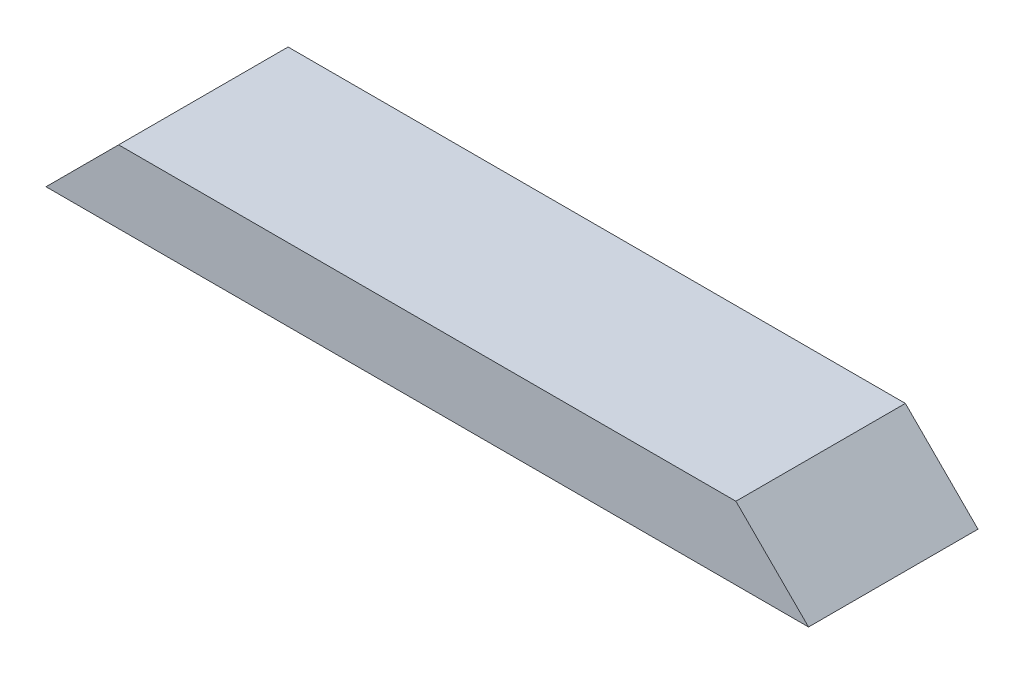
ISO-10303-21;
HEADER;
FILE_DESCRIPTION(('STEP AP214'),'2;1');
FILE_NAME('part.step','',(''),(''),'','','');
FILE_SCHEMA(('AUTOMOTIVE_DESIGN { 1 0 10303 214 1 1 1 1 }'));
ENDSEC;
DATA;
#1=APPLICATION_CONTEXT('core data for automotive mechanical design processes');
#2=APPLICATION_PROTOCOL_DEFINITION('international standard','automotive_design',2000,#1);
#3=PRODUCT_CONTEXT('',#1,'mechanical');
#4=PRODUCT('Part','Part','',(#3));
#5=PRODUCT_RELATED_PRODUCT_CATEGORY('part','',(#4));
#6=PRODUCT_DEFINITION_FORMATION('','',#4);
#7=PRODUCT_DEFINITION_CONTEXT('part definition',#1,'design');
#8=PRODUCT_DEFINITION('design','',#6,#7);
#9=PRODUCT_DEFINITION_SHAPE('','',#8);
#10=(LENGTH_UNIT() NAMED_UNIT(*) SI_UNIT(.MILLI.,.METRE.));
#11=(NAMED_UNIT(*) PLANE_ANGLE_UNIT() SI_UNIT($,.RADIAN.));
#12=(NAMED_UNIT(*) SI_UNIT($,.STERADIAN.) SOLID_ANGLE_UNIT());
#13=UNCERTAINTY_MEASURE_WITH_UNIT(LENGTH_MEASURE(1.E-05),#10,'distance_accuracy_value','');
#14=(GEOMETRIC_REPRESENTATION_CONTEXT(3) GLOBAL_UNCERTAINTY_ASSIGNED_CONTEXT((#13)) GLOBAL_UNIT_ASSIGNED_CONTEXT((#10,
#11,#12)) REPRESENTATION_CONTEXT('',''));
#15=CARTESIAN_POINT('',(0.,0.,0.));
#16=DIRECTION('',(0.,0.,1.));
#17=DIRECTION('',(1.,0.,0.));
#18=AXIS2_PLACEMENT_3D('',#15,#16,#17);
#19=CARTESIAN_POINT('',(0.,38.1,0.));
#20=DIRECTION('',(0.,0.,-1.));
#21=DIRECTION('',(-1.,0.,0.));
#22=AXIS2_PLACEMENT_3D('',#19,#20,#21);
#23=PLANE('',#22);
#24=DIRECTION('',(1.,0.,0.));
#25=VECTOR('',#24,1.);
#26=CARTESIAN_POINT('',(0.,38.1,0.));
#27=LINE('',#26,#25);
#28=CARTESIAN_POINT('',(38.1,38.1,0.));
#29=VERTEX_POINT('',#28);
#30=CARTESIAN_POINT('',(361.95,38.0999999999997,0.));
#31=VERTEX_POINT('',#30);
#32=EDGE_CURVE('E47',#29,#31,#27,.T.);
#33=ORIENTED_EDGE('',*,*,#32,.F.);
#34=DIRECTION('',(0.707106781186547,0.707106781186547,0.));
#35=VECTOR('',#34,1.);
#36=CARTESIAN_POINT('',(0.,0.,0.));
#37=LINE('',#36,#35);
#38=CARTESIAN_POINT('',(0.,0.,0.));
#39=VERTEX_POINT('',#38);
#40=EDGE_CURVE('E82',#39,#29,#37,.T.);
#41=ORIENTED_EDGE('',*,*,#40,.F.);
#42=DIRECTION('',(1.,0.,0.));
#43=VECTOR('',#42,1.);
#44=CARTESIAN_POINT('',(0.,0.,0.));
#45=LINE('',#44,#43);
#46=CARTESIAN_POINT('',(400.05,0.,0.));
#47=VERTEX_POINT('',#46);
#48=EDGE_CURVE('E87',#39,#47,#45,.T.);
#49=ORIENTED_EDGE('',*,*,#48,.T.);
#50=DIRECTION('',(0.70710678118655,-0.707106781186545,0.));
#51=VECTOR('',#50,1.);
#52=CARTESIAN_POINT('',(361.95,38.0999999999997,0.));
#53=LINE('',#52,#51);
#54=EDGE_CURVE('E63',#31,#47,#53,.T.);
#55=ORIENTED_EDGE('',*,*,#54,.F.);
#56=EDGE_LOOP('',(#33,#41,#49,#55));
#57=FACE_BOUND('',#56,.T.);
#58=ADVANCED_FACE('F39',(#57),#23,.F.);
#59=CARTESIAN_POINT('',(0.,38.1,-88.9));
#60=DIRECTION('',(0.,0.,1.));
#61=DIRECTION('',(1.,0.,0.));
#62=AXIS2_PLACEMENT_3D('',#59,#60,#61);
#63=PLANE('',#62);
#64=DIRECTION('',(-1.,0.,0.));
#65=VECTOR('',#64,1.);
#66=CARTESIAN_POINT('',(0.,0.,-88.9));
#67=LINE('',#66,#65);
#68=CARTESIAN_POINT('',(400.05,0.,-88.9));
#69=VERTEX_POINT('',#68);
#70=CARTESIAN_POINT('',(0.,0.,-88.9));
#71=VERTEX_POINT('',#70);
#72=EDGE_CURVE('E42',#69,#71,#67,.T.);
#73=ORIENTED_EDGE('',*,*,#72,.T.);
#74=DIRECTION('',(0.707106781186547,0.707106781186547,0.));
#75=VECTOR('',#74,1.);
#76=CARTESIAN_POINT('',(0.,0.,-88.9));
#77=LINE('',#76,#75);
#78=CARTESIAN_POINT('',(38.1,38.1,-88.9));
#79=VERTEX_POINT('',#78);
#80=EDGE_CURVE('E55',#71,#79,#77,.T.);
#81=ORIENTED_EDGE('',*,*,#80,.T.);
#82=DIRECTION('',(-1.,0.,0.));
#83=VECTOR('',#82,1.);
#84=CARTESIAN_POINT('',(0.,38.1,-88.9));
#85=LINE('',#84,#83);
#86=CARTESIAN_POINT('',(361.95,38.0999999999997,-88.9));
#87=VERTEX_POINT('',#86);
#88=EDGE_CURVE('E11',#87,#79,#85,.T.);
#89=ORIENTED_EDGE('',*,*,#88,.F.);
#90=DIRECTION('',(0.70710678118655,-0.707106781186545,0.));
#91=VECTOR('',#90,1.);
#92=CARTESIAN_POINT('',(361.95,38.0999999999997,-88.9));
#93=LINE('',#92,#91);
#94=EDGE_CURVE('E100',#87,#69,#93,.T.);
#95=ORIENTED_EDGE('',*,*,#94,.T.);
#96=EDGE_LOOP('',(#73,#81,#89,#95));
#97=FACE_BOUND('',#96,.T.);
#98=ADVANCED_FACE('F109',(#97),#63,.F.);
#99=CARTESIAN_POINT('',(0.,38.1,0.));
#100=DIRECTION('',(0.,-1.,0.));
#101=DIRECTION('',(0.,0.,-1.));
#102=AXIS2_PLACEMENT_3D('',#99,#100,#101);
#103=PLANE('',#102);
#104=ORIENTED_EDGE('',*,*,#88,.T.);
#105=DIRECTION('',(0.,0.,1.));
#106=VECTOR('',#105,1.);
#107=CARTESIAN_POINT('',(38.1,38.1,-88.9));
#108=LINE('',#107,#106);
#109=EDGE_CURVE('E88',#79,#29,#108,.T.);
#110=ORIENTED_EDGE('',*,*,#109,.T.);
#111=ORIENTED_EDGE('',*,*,#32,.T.);
#112=DIRECTION('',(0.,0.,1.));
#113=VECTOR('',#112,1.);
#114=CARTESIAN_POINT('',(361.95,38.0999999999997,-88.9));
#115=LINE('',#114,#113);
#116=EDGE_CURVE('E103',#87,#31,#115,.T.);
#117=ORIENTED_EDGE('',*,*,#116,.F.);
#118=EDGE_LOOP('',(#104,#110,#111,#117));
#119=FACE_BOUND('',#118,.T.);
#120=ADVANCED_FACE('F112',(#119),#103,.F.);
#121=CARTESIAN_POINT('',(0.,0.,0.));
#122=DIRECTION('',(0.,-1.,0.));
#123=DIRECTION('',(0.,0.,-1.));
#124=AXIS2_PLACEMENT_3D('',#121,#122,#123);
#125=PLANE('',#124);
#126=DIRECTION('',(0.,0.,1.));
#127=VECTOR('',#126,1.);
#128=CARTESIAN_POINT('',(0.,0.,0.));
#129=LINE('',#128,#127);
#130=EDGE_CURVE('E79',#71,#39,#129,.T.);
#131=ORIENTED_EDGE('',*,*,#130,.F.);
#132=ORIENTED_EDGE('',*,*,#72,.F.);
#133=DIRECTION('',(0.,0.,-1.));
#134=VECTOR('',#133,1.);
#135=CARTESIAN_POINT('',(400.05,0.,0.));
#136=LINE('',#135,#134);
#137=EDGE_CURVE('E96',#47,#69,#136,.T.);
#138=ORIENTED_EDGE('',*,*,#137,.F.);
#139=ORIENTED_EDGE('',*,*,#48,.F.);
#140=EDGE_LOOP('',(#131,#132,#138,#139));
#141=FACE_BOUND('',#140,.T.);
#142=ADVANCED_FACE('F95',(#141),#125,.T.);
#143=CARTESIAN_POINT('',(361.95,38.0999999999997,-88.9));
#144=DIRECTION('',(-0.707106781186545,-0.70710678118655,0.));
#145=DIRECTION('',(0.70710678118655,-0.707106781186545,0.));
#146=AXIS2_PLACEMENT_3D('',#143,#144,#145);
#147=PLANE('',#146);
#148=ORIENTED_EDGE('',*,*,#54,.T.);
#149=ORIENTED_EDGE('',*,*,#137,.T.);
#150=ORIENTED_EDGE('',*,*,#94,.F.);
#151=ORIENTED_EDGE('',*,*,#116,.T.);
#152=EDGE_LOOP('',(#148,#149,#150,#151));
#153=FACE_BOUND('',#152,.T.);
#154=ADVANCED_FACE('F113',(#153),#147,.F.);
#155=CARTESIAN_POINT('',(0.,0.,-88.9));
#156=DIRECTION('',(0.707106781186547,-0.707106781186547,0.));
#157=DIRECTION('',(0.707106781186548,0.707106781186548,0.));
#158=AXIS2_PLACEMENT_3D('',#155,#156,#157);
#159=PLANE('',#158);
#160=ORIENTED_EDGE('',*,*,#40,.T.);
#161=ORIENTED_EDGE('',*,*,#109,.F.);
#162=ORIENTED_EDGE('',*,*,#80,.F.);
#163=ORIENTED_EDGE('',*,*,#130,.T.);
#164=EDGE_LOOP('',(#160,#161,#162,#163));
#165=FACE_BOUND('',#164,.T.);
#166=ADVANCED_FACE('F81',(#165),#159,.F.);
#167=CLOSED_SHELL('',(#58,#98,#120,#142,#154,#166));
#168=MANIFOLD_SOLID_BREP('B2',#167);
#169=ADVANCED_BREP_SHAPE_REPRESENTATION('',(#18,#168),#14);
#170=SHAPE_DEFINITION_REPRESENTATION(#9,#169);
ENDSEC;
END-ISO-10303-21;
